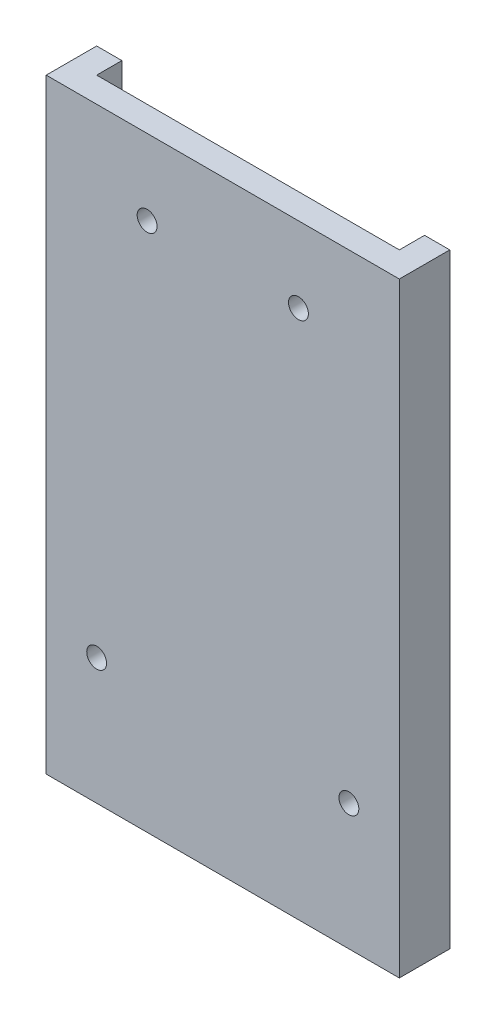
ISO-10303-21;
HEADER;
FILE_DESCRIPTION(('STEP AP214'),'2;1');
FILE_NAME('part.step','',(''),(''),'','','');
FILE_SCHEMA(('AUTOMOTIVE_DESIGN { 1 0 10303 214 1 1 1 1 }'));
ENDSEC;
DATA;
#1=APPLICATION_CONTEXT('core data for automotive mechanical design processes');
#2=APPLICATION_PROTOCOL_DEFINITION('international standard','automotive_design',2000,#1);
#3=PRODUCT_CONTEXT('',#1,'mechanical');
#4=PRODUCT('Part','Part','',(#3));
#5=PRODUCT_RELATED_PRODUCT_CATEGORY('part','',(#4));
#6=PRODUCT_DEFINITION_FORMATION('','',#4);
#7=PRODUCT_DEFINITION_CONTEXT('part definition',#1,'design');
#8=PRODUCT_DEFINITION('design','',#6,#7);
#9=PRODUCT_DEFINITION_SHAPE('','',#8);
#10=(LENGTH_UNIT() NAMED_UNIT(*) SI_UNIT(.MILLI.,.METRE.));
#11=(NAMED_UNIT(*) PLANE_ANGLE_UNIT() SI_UNIT($,.RADIAN.));
#12=(NAMED_UNIT(*) SI_UNIT($,.STERADIAN.) SOLID_ANGLE_UNIT());
#13=UNCERTAINTY_MEASURE_WITH_UNIT(LENGTH_MEASURE(1.E-05),#10,'distance_accuracy_value','');
#14=(GEOMETRIC_REPRESENTATION_CONTEXT(3) GLOBAL_UNCERTAINTY_ASSIGNED_CONTEXT((#13)) GLOBAL_UNIT_ASSIGNED_CONTEXT((#10,
#11,#12)) REPRESENTATION_CONTEXT('',''));
#15=CARTESIAN_POINT('',(0.,0.,0.));
#16=DIRECTION('',(0.,0.,1.));
#17=DIRECTION('',(1.,0.,0.));
#18=AXIS2_PLACEMENT_3D('',#15,#16,#17);
#19=CARTESIAN_POINT('',(22.225,76.2,-3.175));
#20=DIRECTION('',(-1.,0.,0.));
#21=DIRECTION('',(0.,0.,1.));
#22=AXIS2_PLACEMENT_3D('',#19,#20,#21);
#23=PLANE('',#22);
#24=DIRECTION('',(0.,0.,-1.));
#25=VECTOR('',#24,1.);
#26=CARTESIAN_POINT('',(22.225,0.,-3.175));
#27=LINE('',#26,#25);
#28=CARTESIAN_POINT('',(22.225,0.,3.175));
#29=VERTEX_POINT('',#28);
#30=CARTESIAN_POINT('',(22.225,0.,-3.175));
#31=VERTEX_POINT('',#30);
#32=EDGE_CURVE('E135',#29,#31,#27,.T.);
#33=ORIENTED_EDGE('',*,*,#32,.T.);
#34=DIRECTION('',(0.,-1.,0.));
#35=VECTOR('',#34,1.);
#36=CARTESIAN_POINT('',(22.225,76.2,-3.175));
#37=LINE('',#36,#35);
#38=CARTESIAN_POINT('',(22.225,76.2,-3.175));
#39=VERTEX_POINT('',#38);
#40=EDGE_CURVE('E12',#39,#31,#37,.T.);
#41=ORIENTED_EDGE('',*,*,#40,.F.);
#42=DIRECTION('',(0.,0.,-1.));
#43=VECTOR('',#42,1.);
#44=CARTESIAN_POINT('',(22.225,76.2,-3.175));
#45=LINE('',#44,#43);
#46=CARTESIAN_POINT('',(22.225,76.2,3.175));
#47=VERTEX_POINT('',#46);
#48=EDGE_CURVE('E137',#47,#39,#45,.T.);
#49=ORIENTED_EDGE('',*,*,#48,.F.);
#50=DIRECTION('',(0.,-1.,0.));
#51=VECTOR('',#50,1.);
#52=CARTESIAN_POINT('',(22.225,76.2,3.175));
#53=LINE('',#52,#51);
#54=EDGE_CURVE('E144',#47,#29,#53,.T.);
#55=ORIENTED_EDGE('',*,*,#54,.T.);
#56=EDGE_LOOP('',(#33,#41,#49,#55));
#57=FACE_BOUND('',#56,.T.);
#58=ADVANCED_FACE('F35',(#57),#23,.F.);
#59=CARTESIAN_POINT('',(-22.225,76.2,-3.175));
#60=DIRECTION('',(0.,0.,1.));
#61=DIRECTION('',(1.,0.,0.));
#62=AXIS2_PLACEMENT_3D('',#59,#60,#61);
#63=PLANE('',#62);
#64=DIRECTION('',(-1.,0.,0.));
#65=VECTOR('',#64,1.);
#66=CARTESIAN_POINT('',(-22.225,76.2,-3.175));
#67=LINE('',#66,#65);
#68=CARTESIAN_POINT('',(-19.05,76.2,-3.175));
#69=VERTEX_POINT('',#68);
#70=CARTESIAN_POINT('',(-22.225,76.2,-3.175));
#71=VERTEX_POINT('',#70);
#72=EDGE_CURVE('E139',#69,#71,#67,.T.);
#73=ORIENTED_EDGE('',*,*,#72,.F.);
#74=DIRECTION('',(0.,1.,0.));
#75=VECTOR('',#74,1.);
#76=CARTESIAN_POINT('',(-19.05,-38.2320627876656,-3.175));
#77=LINE('',#76,#75);
#78=CARTESIAN_POINT('',(-19.05,3.175,-3.175));
#79=VERTEX_POINT('',#78);
#80=EDGE_CURVE('E130',#79,#69,#77,.T.);
#81=ORIENTED_EDGE('',*,*,#80,.F.);
#82=DIRECTION('',(1.,0.,0.));
#83=VECTOR('',#82,1.);
#84=CARTESIAN_POINT('',(-19.05,3.175,-3.175));
#85=LINE('',#84,#83);
#86=CARTESIAN_POINT('',(19.05,3.175,-3.175));
#87=VERTEX_POINT('',#86);
#88=EDGE_CURVE('E196',#79,#87,#85,.T.);
#89=ORIENTED_EDGE('',*,*,#88,.T.);
#90=DIRECTION('',(0.,1.,0.));
#91=VECTOR('',#90,1.);
#92=CARTESIAN_POINT('',(19.05,-38.2320627876656,-3.175));
#93=LINE('',#92,#91);
#94=CARTESIAN_POINT('',(19.05,76.2,-3.175));
#95=VERTEX_POINT('',#94);
#96=EDGE_CURVE('E118',#87,#95,#93,.T.);
#97=ORIENTED_EDGE('',*,*,#96,.T.);
#98=EDGE_CURVE('E86',#39,#95,#67,.T.);
#99=ORIENTED_EDGE('',*,*,#98,.F.);
#100=ORIENTED_EDGE('',*,*,#40,.T.);
#101=DIRECTION('',(-1.,0.,0.));
#102=VECTOR('',#101,1.);
#103=CARTESIAN_POINT('',(-22.225,0.,-3.175));
#104=LINE('',#103,#102);
#105=CARTESIAN_POINT('',(-22.225,0.,-3.175));
#106=VERTEX_POINT('',#105);
#107=EDGE_CURVE('E147',#31,#106,#104,.T.);
#108=ORIENTED_EDGE('',*,*,#107,.T.);
#109=DIRECTION('',(0.,-1.,0.));
#110=VECTOR('',#109,1.);
#111=CARTESIAN_POINT('',(-22.225,76.2,-3.175));
#112=LINE('',#111,#110);
#113=EDGE_CURVE('E42',#71,#106,#112,.T.);
#114=ORIENTED_EDGE('',*,*,#113,.F.);
#115=EDGE_LOOP('',(#73,#81,#89,#97,#99,#100,#108,#114));
#116=FACE_BOUND('',#115,.T.);
#117=ADVANCED_FACE('F177',(#116),#63,.F.);
#118=CARTESIAN_POINT('',(-22.225,76.2,-3.175));
#119=DIRECTION('',(1.,0.,0.));
#120=DIRECTION('',(0.,0.,-1.));
#121=AXIS2_PLACEMENT_3D('',#118,#119,#120);
#122=PLANE('',#121);
#123=DIRECTION('',(0.,0.,1.));
#124=VECTOR('',#123,1.);
#125=CARTESIAN_POINT('',(-22.225,0.,-3.175));
#126=LINE('',#125,#124);
#127=CARTESIAN_POINT('',(-22.225,0.,3.175));
#128=VERTEX_POINT('',#127);
#129=EDGE_CURVE('E149',#106,#128,#126,.T.);
#130=ORIENTED_EDGE('',*,*,#129,.T.);
#131=DIRECTION('',(0.,-1.,0.));
#132=VECTOR('',#131,1.);
#133=CARTESIAN_POINT('',(-22.225,76.2,3.175));
#134=LINE('',#133,#132);
#135=CARTESIAN_POINT('',(-22.225,76.2,3.175));
#136=VERTEX_POINT('',#135);
#137=EDGE_CURVE('E153',#136,#128,#134,.T.);
#138=ORIENTED_EDGE('',*,*,#137,.F.);
#139=DIRECTION('',(0.,0.,1.));
#140=VECTOR('',#139,1.);
#141=CARTESIAN_POINT('',(-22.225,76.2,-3.175));
#142=LINE('',#141,#140);
#143=EDGE_CURVE('E141',#71,#136,#142,.T.);
#144=ORIENTED_EDGE('',*,*,#143,.F.);
#145=ORIENTED_EDGE('',*,*,#113,.T.);
#146=EDGE_LOOP('',(#130,#138,#144,#145));
#147=FACE_BOUND('',#146,.T.);
#148=ADVANCED_FACE('F159',(#147),#122,.F.);
#149=CARTESIAN_POINT('',(-22.225,76.2,3.175));
#150=DIRECTION('',(0.,0.,-1.));
#151=DIRECTION('',(-1.,0.,0.));
#152=AXIS2_PLACEMENT_3D('',#149,#150,#151);
#153=PLANE('',#152);
#154=CARTESIAN_POINT('',(-15.875,15.875,3.175));
#155=DIRECTION('',(0.,0.,-1.));
#156=DIRECTION('',(-1.,0.,0.));
#157=AXIS2_PLACEMENT_3D('',#154,#155,#156);
#158=CIRCLE('',#157,1.25);
#159=CARTESIAN_POINT('',(-17.125,15.875,3.175));
#160=VERTEX_POINT('',#159);
#161=EDGE_CURVE('E205',#160,#160,#158,.T.);
#162=ORIENTED_EDGE('',*,*,#161,.T.);
#163=EDGE_LOOP('',(#162));
#164=FACE_BOUND('',#163,.T.);
#165=CARTESIAN_POINT('',(15.875,15.875,3.175));
#166=DIRECTION('',(0.,0.,-1.));
#167=DIRECTION('',(-1.,0.,0.));
#168=AXIS2_PLACEMENT_3D('',#165,#166,#167);
#169=CIRCLE('',#168,1.25);
#170=CARTESIAN_POINT('',(14.625,15.875,3.175));
#171=VERTEX_POINT('',#170);
#172=EDGE_CURVE('E210',#171,#171,#169,.T.);
#173=ORIENTED_EDGE('',*,*,#172,.T.);
#174=EDGE_LOOP('',(#173));
#175=FACE_BOUND('',#174,.T.);
#176=CARTESIAN_POINT('',(-9.52499999999999,66.675,3.175));
#177=DIRECTION('',(0.,0.,-1.));
#178=DIRECTION('',(-1.,0.,0.));
#179=AXIS2_PLACEMENT_3D('',#176,#177,#178);
#180=CIRCLE('',#179,1.25);
#181=CARTESIAN_POINT('',(-10.775,66.675,3.175));
#182=VERTEX_POINT('',#181);
#183=EDGE_CURVE('E200',#182,#182,#180,.T.);
#184=ORIENTED_EDGE('',*,*,#183,.T.);
#185=EDGE_LOOP('',(#184));
#186=FACE_BOUND('',#185,.T.);
#187=CARTESIAN_POINT('',(9.52500000000001,66.675,3.175));
#188=DIRECTION('',(0.,0.,-1.));
#189=DIRECTION('',(-1.,0.,0.));
#190=AXIS2_PLACEMENT_3D('',#187,#188,#189);
#191=CIRCLE('',#190,1.25);
#192=CARTESIAN_POINT('',(8.27500000000001,66.675,3.175));
#193=VERTEX_POINT('',#192);
#194=EDGE_CURVE('E190',#193,#193,#191,.T.);
#195=ORIENTED_EDGE('',*,*,#194,.T.);
#196=EDGE_LOOP('',(#195));
#197=FACE_BOUND('',#196,.T.);
#198=DIRECTION('',(1.,0.,0.));
#199=VECTOR('',#198,1.);
#200=CARTESIAN_POINT('',(-22.225,0.,3.175));
#201=LINE('',#200,#199);
#202=EDGE_CURVE('E79',#128,#29,#201,.T.);
#203=ORIENTED_EDGE('',*,*,#202,.T.);
#204=ORIENTED_EDGE('',*,*,#54,.F.);
#205=DIRECTION('',(1.,0.,0.));
#206=VECTOR('',#205,1.);
#207=CARTESIAN_POINT('',(-22.225,76.2,3.175));
#208=LINE('',#207,#206);
#209=EDGE_CURVE('E58',#136,#47,#208,.T.);
#210=ORIENTED_EDGE('',*,*,#209,.F.);
#211=ORIENTED_EDGE('',*,*,#137,.T.);
#212=EDGE_LOOP('',(#203,#204,#210,#211));
#213=FACE_BOUND('',#212,.T.);
#214=ADVANCED_FACE('F168',(#164,#175,#186,#197,#213),#153,.F.);
#215=CARTESIAN_POINT('',(0.,76.2,0.));
#216=DIRECTION('',(0.,1.,0.));
#217=DIRECTION('',(0.,0.,1.));
#218=AXIS2_PLACEMENT_3D('',#215,#216,#217);
#219=PLANE('',#218);
#220=DIRECTION('',(0.,0.,1.));
#221=VECTOR('',#220,1.);
#222=CARTESIAN_POINT('',(-19.05,76.2,-3.175));
#223=LINE('',#222,#221);
#224=CARTESIAN_POINT('',(-19.05,76.2,0.));
#225=VERTEX_POINT('',#224);
#226=EDGE_CURVE('E49',#69,#225,#223,.T.);
#227=ORIENTED_EDGE('',*,*,#226,.F.);
#228=ORIENTED_EDGE('',*,*,#72,.T.);
#229=ORIENTED_EDGE('',*,*,#143,.T.);
#230=ORIENTED_EDGE('',*,*,#209,.T.);
#231=ORIENTED_EDGE('',*,*,#48,.T.);
#232=ORIENTED_EDGE('',*,*,#98,.T.);
#233=DIRECTION('',(0.,0.,-1.));
#234=VECTOR('',#233,1.);
#235=CARTESIAN_POINT('',(19.05,76.2,-3.175));
#236=LINE('',#235,#234);
#237=CARTESIAN_POINT('',(19.05,76.2,0.));
#238=VERTEX_POINT('',#237);
#239=EDGE_CURVE('E114',#238,#95,#236,.T.);
#240=ORIENTED_EDGE('',*,*,#239,.F.);
#241=DIRECTION('',(1.,0.,0.));
#242=VECTOR('',#241,1.);
#243=CARTESIAN_POINT('',(-19.05,76.2,0.));
#244=LINE('',#243,#242);
#245=EDGE_CURVE('E122',#225,#238,#244,.T.);
#246=ORIENTED_EDGE('',*,*,#245,.F.);
#247=EDGE_LOOP('',(#227,#228,#229,#230,#231,#232,#240,#246));
#248=FACE_BOUND('',#247,.T.);
#249=ADVANCED_FACE('F125',(#248),#219,.T.);
#250=CARTESIAN_POINT('',(0.,0.,0.));
#251=DIRECTION('',(0.,1.,0.));
#252=DIRECTION('',(0.,0.,1.));
#253=AXIS2_PLACEMENT_3D('',#250,#251,#252);
#254=PLANE('',#253);
#255=ORIENTED_EDGE('',*,*,#32,.F.);
#256=ORIENTED_EDGE('',*,*,#202,.F.);
#257=ORIENTED_EDGE('',*,*,#129,.F.);
#258=ORIENTED_EDGE('',*,*,#107,.F.);
#259=EDGE_LOOP('',(#255,#256,#257,#258));
#260=FACE_BOUND('',#259,.T.);
#261=ADVANCED_FACE('F164',(#260),#254,.F.);
#262=CARTESIAN_POINT('',(-19.05,-38.2320627876656,-3.175));
#263=DIRECTION('',(-1.,0.,0.));
#264=DIRECTION('',(0.,0.,1.));
#265=AXIS2_PLACEMENT_3D('',#262,#263,#264);
#266=PLANE('',#265);
#267=DIRECTION('',(0.,0.,-1.));
#268=VECTOR('',#267,1.);
#269=CARTESIAN_POINT('',(-19.05,3.175,-3.175));
#270=LINE('',#269,#268);
#271=CARTESIAN_POINT('',(-19.05,3.175,0.));
#272=VERTEX_POINT('',#271);
#273=EDGE_CURVE('E136',#272,#79,#270,.T.);
#274=ORIENTED_EDGE('',*,*,#273,.T.);
#275=ORIENTED_EDGE('',*,*,#80,.T.);
#276=ORIENTED_EDGE('',*,*,#226,.T.);
#277=DIRECTION('',(0.,1.,0.));
#278=VECTOR('',#277,1.);
#279=CARTESIAN_POINT('',(-19.05,-38.2320627876656,0.));
#280=LINE('',#279,#278);
#281=EDGE_CURVE('E119',#272,#225,#280,.T.);
#282=ORIENTED_EDGE('',*,*,#281,.F.);
#283=EDGE_LOOP('',(#274,#275,#276,#282));
#284=FACE_BOUND('',#283,.T.);
#285=ADVANCED_FACE('F250',(#284),#266,.F.);
#286=CARTESIAN_POINT('',(19.05,-38.2320627876656,-3.175));
#287=DIRECTION('',(1.,0.,0.));
#288=DIRECTION('',(0.,0.,-1.));
#289=AXIS2_PLACEMENT_3D('',#286,#287,#288);
#290=PLANE('',#289);
#291=DIRECTION('',(0.,0.,1.));
#292=VECTOR('',#291,1.);
#293=CARTESIAN_POINT('',(19.05,3.175,-3.175));
#294=LINE('',#293,#292);
#295=CARTESIAN_POINT('',(19.05,3.17499999999998,0.));
#296=VERTEX_POINT('',#295);
#297=EDGE_CURVE('E115',#87,#296,#294,.T.);
#298=ORIENTED_EDGE('',*,*,#297,.T.);
#299=DIRECTION('',(0.,1.,0.));
#300=VECTOR('',#299,1.);
#301=CARTESIAN_POINT('',(19.05,-38.2320627876656,0.));
#302=LINE('',#301,#300);
#303=EDGE_CURVE('E109',#296,#238,#302,.T.);
#304=ORIENTED_EDGE('',*,*,#303,.T.);
#305=ORIENTED_EDGE('',*,*,#239,.T.);
#306=ORIENTED_EDGE('',*,*,#96,.F.);
#307=EDGE_LOOP('',(#298,#304,#305,#306));
#308=FACE_BOUND('',#307,.T.);
#309=ADVANCED_FACE('F111',(#308),#290,.F.);
#310=CARTESIAN_POINT('',(-19.05,-38.2320627876656,0.));
#311=DIRECTION('',(0.,0.,1.));
#312=DIRECTION('',(1.,0.,0.));
#313=AXIS2_PLACEMENT_3D('',#310,#311,#312);
#314=PLANE('',#313);
#315=CARTESIAN_POINT('',(-15.875,15.875,0.));
#316=DIRECTION('',(0.,0.,-1.));
#317=DIRECTION('',(-1.,0.,0.));
#318=AXIS2_PLACEMENT_3D('',#315,#316,#317);
#319=CIRCLE('',#318,1.25);
#320=CARTESIAN_POINT('',(-17.125,15.875,0.));
#321=VERTEX_POINT('',#320);
#322=EDGE_CURVE('E202',#321,#321,#319,.T.);
#323=ORIENTED_EDGE('',*,*,#322,.F.);
#324=EDGE_LOOP('',(#323));
#325=FACE_BOUND('',#324,.T.);
#326=CARTESIAN_POINT('',(15.875,15.875,0.));
#327=DIRECTION('',(0.,0.,-1.));
#328=DIRECTION('',(-1.,0.,0.));
#329=AXIS2_PLACEMENT_3D('',#326,#327,#328);
#330=CIRCLE('',#329,1.25);
#331=CARTESIAN_POINT('',(14.625,15.875,0.));
#332=VERTEX_POINT('',#331);
#333=EDGE_CURVE('E207',#332,#332,#330,.T.);
#334=ORIENTED_EDGE('',*,*,#333,.F.);
#335=EDGE_LOOP('',(#334));
#336=FACE_BOUND('',#335,.T.);
#337=CARTESIAN_POINT('',(-9.52499999999999,66.675,0.));
#338=DIRECTION('',(0.,0.,-1.));
#339=DIRECTION('',(-1.,0.,0.));
#340=AXIS2_PLACEMENT_3D('',#337,#338,#339);
#341=CIRCLE('',#340,1.25);
#342=CARTESIAN_POINT('',(-10.775,66.675,0.));
#343=VERTEX_POINT('',#342);
#344=EDGE_CURVE('E213',#343,#343,#341,.T.);
#345=ORIENTED_EDGE('',*,*,#344,.F.);
#346=EDGE_LOOP('',(#345));
#347=FACE_BOUND('',#346,.T.);
#348=CARTESIAN_POINT('',(9.52500000000001,66.675,0.));
#349=DIRECTION('',(0.,0.,-1.));
#350=DIRECTION('',(-1.,0.,0.));
#351=AXIS2_PLACEMENT_3D('',#348,#349,#350);
#352=CIRCLE('',#351,1.25);
#353=CARTESIAN_POINT('',(8.27500000000001,66.675,0.));
#354=VERTEX_POINT('',#353);
#355=EDGE_CURVE('E192',#354,#354,#352,.T.);
#356=ORIENTED_EDGE('',*,*,#355,.F.);
#357=EDGE_LOOP('',(#356));
#358=FACE_BOUND('',#357,.T.);
#359=DIRECTION('',(-1.,0.,0.));
#360=VECTOR('',#359,1.);
#361=CARTESIAN_POINT('',(-19.05,3.175,0.));
#362=LINE('',#361,#360);
#363=EDGE_CURVE('E133',#296,#272,#362,.T.);
#364=ORIENTED_EDGE('',*,*,#363,.T.);
#365=ORIENTED_EDGE('',*,*,#281,.T.);
#366=ORIENTED_EDGE('',*,*,#245,.T.);
#367=ORIENTED_EDGE('',*,*,#303,.F.);
#368=EDGE_LOOP('',(#364,#365,#366,#367));
#369=FACE_BOUND('',#368,.T.);
#370=ADVANCED_FACE('F123',(#325,#336,#347,#358,#369),#314,.F.);
#371=CARTESIAN_POINT('',(0.,3.175,0.));
#372=DIRECTION('',(0.,1.,0.));
#373=DIRECTION('',(0.,0.,1.));
#374=AXIS2_PLACEMENT_3D('',#371,#372,#373);
#375=PLANE('',#374);
#376=ORIENTED_EDGE('',*,*,#273,.F.);
#377=ORIENTED_EDGE('',*,*,#363,.F.);
#378=ORIENTED_EDGE('',*,*,#297,.F.);
#379=ORIENTED_EDGE('',*,*,#88,.F.);
#380=EDGE_LOOP('',(#376,#377,#378,#379));
#381=FACE_BOUND('',#380,.T.);
#382=ADVANCED_FACE('F231',(#381),#375,.T.);
#383=CARTESIAN_POINT('',(9.52500000000001,66.675,3.175));
#384=DIRECTION('',(0.,0.,-1.));
#385=DIRECTION('',(-1.,0.,0.));
#386=AXIS2_PLACEMENT_3D('',#383,#384,#385);
#387=CYLINDRICAL_SURFACE('',#386,1.25);
#388=ORIENTED_EDGE('',*,*,#194,.F.);
#389=EDGE_LOOP('',(#388));
#390=FACE_BOUND('',#389,.T.);
#391=ORIENTED_EDGE('',*,*,#355,.T.);
#392=EDGE_LOOP('',(#391));
#393=FACE_BOUND('',#392,.T.);
#394=ADVANCED_FACE('F225',(#390,#393),#387,.F.);
#395=CARTESIAN_POINT('',(-9.52499999999999,66.675,3.175));
#396=DIRECTION('',(0.,0.,-1.));
#397=DIRECTION('',(-1.,0.,0.));
#398=AXIS2_PLACEMENT_3D('',#395,#396,#397);
#399=CYLINDRICAL_SURFACE('',#398,1.25);
#400=ORIENTED_EDGE('',*,*,#183,.F.);
#401=EDGE_LOOP('',(#400));
#402=FACE_BOUND('',#401,.T.);
#403=ORIENTED_EDGE('',*,*,#344,.T.);
#404=EDGE_LOOP('',(#403));
#405=FACE_BOUND('',#404,.T.);
#406=ADVANCED_FACE('F221',(#402,#405),#399,.F.);
#407=CARTESIAN_POINT('',(15.875,15.875,3.175));
#408=DIRECTION('',(0.,0.,-1.));
#409=DIRECTION('',(-1.,0.,0.));
#410=AXIS2_PLACEMENT_3D('',#407,#408,#409);
#411=CYLINDRICAL_SURFACE('',#410,1.25);
#412=ORIENTED_EDGE('',*,*,#172,.F.);
#413=EDGE_LOOP('',(#412));
#414=FACE_BOUND('',#413,.T.);
#415=ORIENTED_EDGE('',*,*,#333,.T.);
#416=EDGE_LOOP('',(#415));
#417=FACE_BOUND('',#416,.T.);
#418=ADVANCED_FACE('F224',(#414,#417),#411,.F.);
#419=CARTESIAN_POINT('',(-15.875,15.875,3.175));
#420=DIRECTION('',(0.,0.,-1.));
#421=DIRECTION('',(-1.,0.,0.));
#422=AXIS2_PLACEMENT_3D('',#419,#420,#421);
#423=CYLINDRICAL_SURFACE('',#422,1.25);
#424=ORIENTED_EDGE('',*,*,#161,.F.);
#425=EDGE_LOOP('',(#424));
#426=FACE_BOUND('',#425,.T.);
#427=ORIENTED_EDGE('',*,*,#322,.T.);
#428=EDGE_LOOP('',(#427));
#429=FACE_BOUND('',#428,.T.);
#430=ADVANCED_FACE('F246',(#426,#429),#423,.F.);
#431=CLOSED_SHELL('',(#58,#117,#148,#214,#249,#261,#285,#309,#370,#382,#394,#406,#418,#430));
#432=MANIFOLD_SOLID_BREP('B2',#431);
#433=ADVANCED_BREP_SHAPE_REPRESENTATION('',(#18,#432),#14);
#434=SHAPE_DEFINITION_REPRESENTATION(#9,#433);
ENDSEC;
END-ISO-10303-21;
